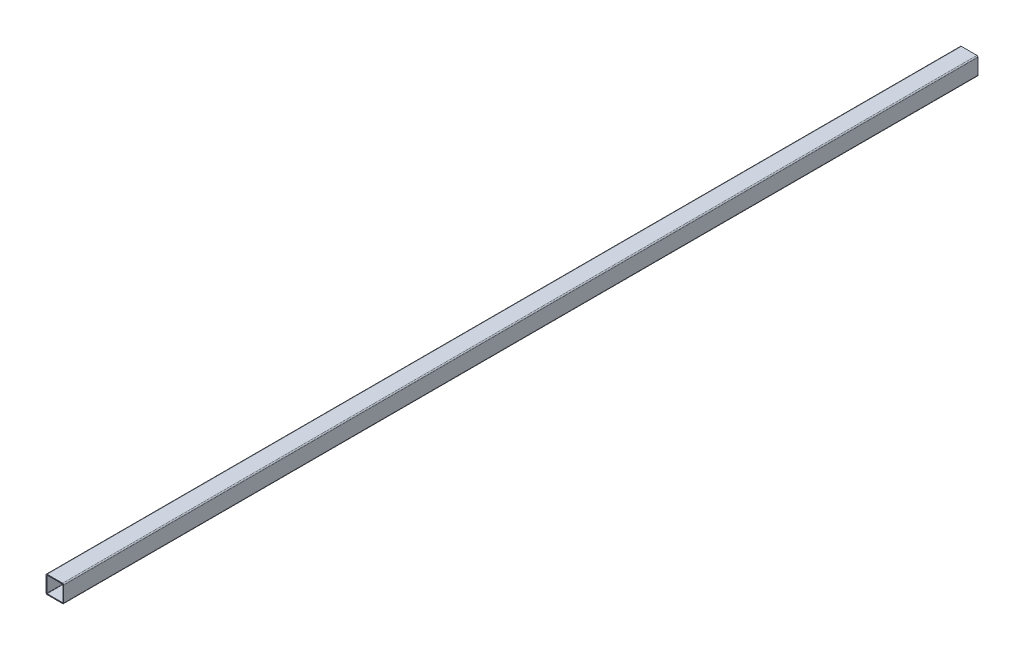
ISO-10303-21;
HEADER;
FILE_DESCRIPTION(('STEP AP214'),'2;1');
FILE_NAME('part.step','',(''),(''),'','','');
FILE_SCHEMA(('AUTOMOTIVE_DESIGN { 1 0 10303 214 1 1 1 1 }'));
ENDSEC;
DATA;
#1=APPLICATION_CONTEXT('core data for automotive mechanical design processes');
#2=APPLICATION_PROTOCOL_DEFINITION('international standard','automotive_design',2000,#1);
#3=PRODUCT_CONTEXT('',#1,'mechanical');
#4=PRODUCT('Part','Part','',(#3));
#5=PRODUCT_RELATED_PRODUCT_CATEGORY('part','',(#4));
#6=PRODUCT_DEFINITION_FORMATION('','',#4);
#7=PRODUCT_DEFINITION_CONTEXT('part definition',#1,'design');
#8=PRODUCT_DEFINITION('design','',#6,#7);
#9=PRODUCT_DEFINITION_SHAPE('','',#8);
#10=(LENGTH_UNIT() NAMED_UNIT(*) SI_UNIT(.MILLI.,.METRE.));
#11=(NAMED_UNIT(*) PLANE_ANGLE_UNIT() SI_UNIT($,.RADIAN.));
#12=(NAMED_UNIT(*) SI_UNIT($,.STERADIAN.) SOLID_ANGLE_UNIT());
#13=UNCERTAINTY_MEASURE_WITH_UNIT(LENGTH_MEASURE(1.E-05),#10,'distance_accuracy_value','');
#14=(GEOMETRIC_REPRESENTATION_CONTEXT(3) GLOBAL_UNCERTAINTY_ASSIGNED_CONTEXT((#13)) GLOBAL_UNIT_ASSIGNED_CONTEXT((#10,
#11,#12)) REPRESENTATION_CONTEXT('',''));
#15=CARTESIAN_POINT('',(0.,0.,0.));
#16=DIRECTION('',(0.,0.,1.));
#17=DIRECTION('',(1.,0.,0.));
#18=AXIS2_PLACEMENT_3D('',#15,#16,#17);
#19=CARTESIAN_POINT('',(14.,-14.,-825.));
#20=DIRECTION('',(0.,0.,1.));
#21=DIRECTION('',(1.,0.,0.));
#22=AXIS2_PLACEMENT_3D('',#19,#20,#21);
#23=CYLINDRICAL_SURFACE('',#22,2.);
#24=DIRECTION('',(0.,0.,1.));
#25=VECTOR('',#24,1.);
#26=CARTESIAN_POINT('',(16.,-14.,-825.));
#27=LINE('',#26,#25);
#28=CARTESIAN_POINT('',(16.,-14.,-825.));
#29=VERTEX_POINT('',#28);
#30=CARTESIAN_POINT('',(16.,-14.,825.));
#31=VERTEX_POINT('',#30);
#32=EDGE_CURVE('E42',#29,#31,#27,.T.);
#33=ORIENTED_EDGE('',*,*,#32,.T.);
#34=CARTESIAN_POINT('',(14.,-14.,825.));
#35=DIRECTION('',(0.,0.,1.));
#36=DIRECTION('',(1.,0.,0.));
#37=AXIS2_PLACEMENT_3D('',#34,#35,#36);
#38=CIRCLE('',#37,2.);
#39=CARTESIAN_POINT('',(14.,-16.,825.));
#40=VERTEX_POINT('',#39);
#41=EDGE_CURVE('E205',#40,#31,#38,.T.);
#42=ORIENTED_EDGE('',*,*,#41,.F.);
#43=DIRECTION('',(0.,0.,1.));
#44=VECTOR('',#43,1.);
#45=CARTESIAN_POINT('',(14.,-16.,-825.));
#46=LINE('',#45,#44);
#47=CARTESIAN_POINT('',(14.,-16.,-825.));
#48=VERTEX_POINT('',#47);
#49=EDGE_CURVE('E11',#48,#40,#46,.T.);
#50=ORIENTED_EDGE('',*,*,#49,.F.);
#51=CARTESIAN_POINT('',(14.,-14.,-825.));
#52=DIRECTION('',(0.,0.,1.));
#53=DIRECTION('',(1.,0.,0.));
#54=AXIS2_PLACEMENT_3D('',#51,#52,#53);
#55=CIRCLE('',#54,2.);
#56=EDGE_CURVE('E265',#48,#29,#55,.T.);
#57=ORIENTED_EDGE('',*,*,#56,.T.);
#58=EDGE_LOOP('',(#33,#42,#50,#57));
#59=FACE_BOUND('',#58,.T.);
#60=ADVANCED_FACE('F39',(#59),#23,.T.);
#61=CARTESIAN_POINT('',(-14.,-16.,-825.));
#62=DIRECTION('',(0.,-1.,0.));
#63=DIRECTION('',(0.,0.,-1.));
#64=AXIS2_PLACEMENT_3D('',#61,#62,#63);
#65=PLANE('',#64);
#66=ORIENTED_EDGE('',*,*,#49,.T.);
#67=DIRECTION('',(1.,0.,0.));
#68=VECTOR('',#67,1.);
#69=CARTESIAN_POINT('',(-14.,-16.,825.));
#70=LINE('',#69,#68);
#71=CARTESIAN_POINT('',(-14.,-16.,825.));
#72=VERTEX_POINT('',#71);
#73=EDGE_CURVE('E233',#72,#40,#70,.T.);
#74=ORIENTED_EDGE('',*,*,#73,.F.);
#75=DIRECTION('',(0.,0.,1.));
#76=VECTOR('',#75,1.);
#77=CARTESIAN_POINT('',(-14.,-16.,-825.));
#78=LINE('',#77,#76);
#79=CARTESIAN_POINT('',(-14.,-16.,-825.));
#80=VERTEX_POINT('',#79);
#81=EDGE_CURVE('E48',#80,#72,#78,.T.);
#82=ORIENTED_EDGE('',*,*,#81,.F.);
#83=DIRECTION('',(1.,0.,0.));
#84=VECTOR('',#83,1.);
#85=CARTESIAN_POINT('',(-14.,-16.,-825.));
#86=LINE('',#85,#84);
#87=EDGE_CURVE('E309',#80,#48,#86,.T.);
#88=ORIENTED_EDGE('',*,*,#87,.T.);
#89=EDGE_LOOP('',(#66,#74,#82,#88));
#90=FACE_BOUND('',#89,.T.);
#91=ADVANCED_FACE('F338',(#90),#65,.T.);
#92=CARTESIAN_POINT('',(-14.,-14.,-825.));
#93=DIRECTION('',(0.,0.,1.));
#94=DIRECTION('',(1.,0.,0.));
#95=AXIS2_PLACEMENT_3D('',#92,#93,#94);
#96=CYLINDRICAL_SURFACE('',#95,2.);
#97=ORIENTED_EDGE('',*,*,#81,.T.);
#98=CARTESIAN_POINT('',(-14.,-14.,825.));
#99=DIRECTION('',(0.,0.,1.));
#100=DIRECTION('',(1.,0.,0.));
#101=AXIS2_PLACEMENT_3D('',#98,#99,#100);
#102=CIRCLE('',#101,2.);
#103=CARTESIAN_POINT('',(-16.,-14.,825.));
#104=VERTEX_POINT('',#103);
#105=EDGE_CURVE('E229',#104,#72,#102,.T.);
#106=ORIENTED_EDGE('',*,*,#105,.F.);
#107=DIRECTION('',(0.,0.,1.));
#108=VECTOR('',#107,1.);
#109=CARTESIAN_POINT('',(-16.,-14.,-825.));
#110=LINE('',#109,#108);
#111=CARTESIAN_POINT('',(-16.,-14.,-825.));
#112=VERTEX_POINT('',#111);
#113=EDGE_CURVE('E315',#112,#104,#110,.T.);
#114=ORIENTED_EDGE('',*,*,#113,.F.);
#115=CARTESIAN_POINT('',(-14.,-14.,-825.));
#116=DIRECTION('',(0.,0.,1.));
#117=DIRECTION('',(1.,0.,0.));
#118=AXIS2_PLACEMENT_3D('',#115,#116,#117);
#119=CIRCLE('',#118,2.);
#120=EDGE_CURVE('E305',#112,#80,#119,.T.);
#121=ORIENTED_EDGE('',*,*,#120,.T.);
#122=EDGE_LOOP('',(#97,#106,#114,#121));
#123=FACE_BOUND('',#122,.T.);
#124=ADVANCED_FACE('F359',(#123),#96,.T.);
#125=CARTESIAN_POINT('',(-16.,-14.,-825.));
#126=DIRECTION('',(-1.,0.,0.));
#127=DIRECTION('',(0.,0.,1.));
#128=AXIS2_PLACEMENT_3D('',#125,#126,#127);
#129=PLANE('',#128);
#130=ORIENTED_EDGE('',*,*,#113,.T.);
#131=DIRECTION('',(0.,-1.,0.));
#132=VECTOR('',#131,1.);
#133=CARTESIAN_POINT('',(-16.,-14.,825.));
#134=LINE('',#133,#132);
#135=CARTESIAN_POINT('',(-16.,14.,825.));
#136=VERTEX_POINT('',#135);
#137=EDGE_CURVE('E225',#136,#104,#134,.T.);
#138=ORIENTED_EDGE('',*,*,#137,.F.);
#139=DIRECTION('',(0.,0.,1.));
#140=VECTOR('',#139,1.);
#141=CARTESIAN_POINT('',(-16.,14.,-825.));
#142=LINE('',#141,#140);
#143=CARTESIAN_POINT('',(-16.,14.,-825.));
#144=VERTEX_POINT('',#143);
#145=EDGE_CURVE('E318',#144,#136,#142,.T.);
#146=ORIENTED_EDGE('',*,*,#145,.F.);
#147=DIRECTION('',(0.,-1.,0.));
#148=VECTOR('',#147,1.);
#149=CARTESIAN_POINT('',(-16.,-14.,-825.));
#150=LINE('',#149,#148);
#151=EDGE_CURVE('E301',#144,#112,#150,.T.);
#152=ORIENTED_EDGE('',*,*,#151,.T.);
#153=EDGE_LOOP('',(#130,#138,#146,#152));
#154=FACE_BOUND('',#153,.T.);
#155=ADVANCED_FACE('F356',(#154),#129,.T.);
#156=CARTESIAN_POINT('',(-14.,14.,-825.));
#157=DIRECTION('',(0.,0.,1.));
#158=DIRECTION('',(1.,0.,0.));
#159=AXIS2_PLACEMENT_3D('',#156,#157,#158);
#160=CYLINDRICAL_SURFACE('',#159,2.);
#161=ORIENTED_EDGE('',*,*,#145,.T.);
#162=CARTESIAN_POINT('',(-14.,14.,825.));
#163=DIRECTION('',(0.,0.,1.));
#164=DIRECTION('',(-1.,0.,0.));
#165=AXIS2_PLACEMENT_3D('',#162,#163,#164);
#166=CIRCLE('',#165,2.);
#167=CARTESIAN_POINT('',(-14.,16.,825.));
#168=VERTEX_POINT('',#167);
#169=EDGE_CURVE('E221',#168,#136,#166,.T.);
#170=ORIENTED_EDGE('',*,*,#169,.F.);
#171=DIRECTION('',(0.,0.,1.));
#172=VECTOR('',#171,1.);
#173=CARTESIAN_POINT('',(-14.,16.,-825.));
#174=LINE('',#173,#172);
#175=CARTESIAN_POINT('',(-14.,16.,-825.));
#176=VERTEX_POINT('',#175);
#177=EDGE_CURVE('E321',#176,#168,#174,.T.);
#178=ORIENTED_EDGE('',*,*,#177,.F.);
#179=CARTESIAN_POINT('',(-14.,14.,-825.));
#180=DIRECTION('',(0.,0.,1.));
#181=DIRECTION('',(-1.,0.,0.));
#182=AXIS2_PLACEMENT_3D('',#179,#180,#181);
#183=CIRCLE('',#182,2.);
#184=EDGE_CURVE('E297',#176,#144,#183,.T.);
#185=ORIENTED_EDGE('',*,*,#184,.T.);
#186=EDGE_LOOP('',(#161,#170,#178,#185));
#187=FACE_BOUND('',#186,.T.);
#188=ADVANCED_FACE('F354',(#187),#160,.T.);
#189=CARTESIAN_POINT('',(-14.,16.,-825.));
#190=DIRECTION('',(0.,1.,0.));
#191=DIRECTION('',(0.,0.,1.));
#192=AXIS2_PLACEMENT_3D('',#189,#190,#191);
#193=PLANE('',#192);
#194=ORIENTED_EDGE('',*,*,#177,.T.);
#195=DIRECTION('',(-1.,0.,0.));
#196=VECTOR('',#195,1.);
#197=CARTESIAN_POINT('',(-14.,16.,825.));
#198=LINE('',#197,#196);
#199=CARTESIAN_POINT('',(14.,16.,825.));
#200=VERTEX_POINT('',#199);
#201=EDGE_CURVE('E217',#200,#168,#198,.T.);
#202=ORIENTED_EDGE('',*,*,#201,.F.);
#203=DIRECTION('',(0.,0.,1.));
#204=VECTOR('',#203,1.);
#205=CARTESIAN_POINT('',(14.,16.,-825.));
#206=LINE('',#205,#204);
#207=CARTESIAN_POINT('',(14.,16.,-825.));
#208=VERTEX_POINT('',#207);
#209=EDGE_CURVE('E324',#208,#200,#206,.T.);
#210=ORIENTED_EDGE('',*,*,#209,.F.);
#211=DIRECTION('',(-1.,0.,0.));
#212=VECTOR('',#211,1.);
#213=CARTESIAN_POINT('',(-14.,16.,-825.));
#214=LINE('',#213,#212);
#215=EDGE_CURVE('E293',#208,#176,#214,.T.);
#216=ORIENTED_EDGE('',*,*,#215,.T.);
#217=EDGE_LOOP('',(#194,#202,#210,#216));
#218=FACE_BOUND('',#217,.T.);
#219=ADVANCED_FACE('F352',(#218),#193,.T.);
#220=CARTESIAN_POINT('',(14.,14.,-825.));
#221=DIRECTION('',(0.,0.,1.));
#222=DIRECTION('',(1.,0.,0.));
#223=AXIS2_PLACEMENT_3D('',#220,#221,#222);
#224=CYLINDRICAL_SURFACE('',#223,2.);
#225=ORIENTED_EDGE('',*,*,#209,.T.);
#226=CARTESIAN_POINT('',(14.,14.,825.));
#227=DIRECTION('',(0.,0.,1.));
#228=DIRECTION('',(1.,0.,0.));
#229=AXIS2_PLACEMENT_3D('',#226,#227,#228);
#230=CIRCLE('',#229,2.);
#231=CARTESIAN_POINT('',(16.,14.,825.));
#232=VERTEX_POINT('',#231);
#233=EDGE_CURVE('E213',#232,#200,#230,.T.);
#234=ORIENTED_EDGE('',*,*,#233,.F.);
#235=DIRECTION('',(0.,0.,1.));
#236=VECTOR('',#235,1.);
#237=CARTESIAN_POINT('',(16.,14.,-825.));
#238=LINE('',#237,#236);
#239=CARTESIAN_POINT('',(16.,14.,-825.));
#240=VERTEX_POINT('',#239);
#241=EDGE_CURVE('E326',#240,#232,#238,.T.);
#242=ORIENTED_EDGE('',*,*,#241,.F.);
#243=CARTESIAN_POINT('',(14.,14.,-825.));
#244=DIRECTION('',(0.,0.,1.));
#245=DIRECTION('',(1.,0.,0.));
#246=AXIS2_PLACEMENT_3D('',#243,#244,#245);
#247=CIRCLE('',#246,2.);
#248=EDGE_CURVE('E289',#240,#208,#247,.T.);
#249=ORIENTED_EDGE('',*,*,#248,.T.);
#250=EDGE_LOOP('',(#225,#234,#242,#249));
#251=FACE_BOUND('',#250,.T.);
#252=ADVANCED_FACE('F348',(#251),#224,.T.);
#253=CARTESIAN_POINT('',(16.,-14.,-825.));
#254=DIRECTION('',(1.,0.,0.));
#255=DIRECTION('',(0.,0.,-1.));
#256=AXIS2_PLACEMENT_3D('',#253,#254,#255);
#257=PLANE('',#256);
#258=ORIENTED_EDGE('',*,*,#241,.T.);
#259=DIRECTION('',(0.,1.,0.));
#260=VECTOR('',#259,1.);
#261=CARTESIAN_POINT('',(16.,-14.,825.));
#262=LINE('',#261,#260);
#263=EDGE_CURVE('E209',#31,#232,#262,.T.);
#264=ORIENTED_EDGE('',*,*,#263,.F.);
#265=ORIENTED_EDGE('',*,*,#32,.F.);
#266=DIRECTION('',(0.,1.,0.));
#267=VECTOR('',#266,1.);
#268=CARTESIAN_POINT('',(16.,-14.,-825.));
#269=LINE('',#268,#267);
#270=EDGE_CURVE('E285',#29,#240,#269,.T.);
#271=ORIENTED_EDGE('',*,*,#270,.T.);
#272=EDGE_LOOP('',(#258,#264,#265,#271));
#273=FACE_BOUND('',#272,.T.);
#274=ADVANCED_FACE('F332',(#273),#257,.T.);
#275=CARTESIAN_POINT('',(14.,-14.,-825.));
#276=DIRECTION('',(0.,0.,1.));
#277=DIRECTION('',(1.,0.,0.));
#278=AXIS2_PLACEMENT_3D('',#275,#276,#277);
#279=PLANE('',#278);
#280=DIRECTION('',(-1.,0.,0.));
#281=VECTOR('',#280,1.);
#282=CARTESIAN_POINT('',(-14.,14.48,-825.));
#283=LINE('',#282,#281);
#284=CARTESIAN_POINT('',(14.,14.48,-825.));
#285=VERTEX_POINT('',#284);
#286=CARTESIAN_POINT('',(-14.,14.48,-825.));
#287=VERTEX_POINT('',#286);
#288=EDGE_CURVE('E166',#285,#287,#283,.T.);
#289=ORIENTED_EDGE('',*,*,#288,.T.);
#290=CARTESIAN_POINT('',(-14.,14.,-825.));
#291=DIRECTION('',(0.,0.,1.));
#292=DIRECTION('',(-1.,0.,0.));
#293=AXIS2_PLACEMENT_3D('',#290,#291,#292);
#294=CIRCLE('',#293,0.48);
#295=CARTESIAN_POINT('',(-14.48,14.,-825.));
#296=VERTEX_POINT('',#295);
#297=EDGE_CURVE('E237',#287,#296,#294,.T.);
#298=ORIENTED_EDGE('',*,*,#297,.T.);
#299=DIRECTION('',(0.,-1.,0.));
#300=VECTOR('',#299,1.);
#301=CARTESIAN_POINT('',(-14.48,-14.,-825.));
#302=LINE('',#301,#300);
#303=CARTESIAN_POINT('',(-14.48,-14.,-825.));
#304=VERTEX_POINT('',#303);
#305=EDGE_CURVE('E160',#296,#304,#302,.T.);
#306=ORIENTED_EDGE('',*,*,#305,.T.);
#307=CARTESIAN_POINT('',(-14.,-14.,-825.));
#308=DIRECTION('',(0.,0.,1.));
#309=DIRECTION('',(1.,0.,0.));
#310=AXIS2_PLACEMENT_3D('',#307,#308,#309);
#311=CIRCLE('',#310,0.48);
#312=CARTESIAN_POINT('',(-14.,-14.48,-825.));
#313=VERTEX_POINT('',#312);
#314=EDGE_CURVE('E56',#304,#313,#311,.T.);
#315=ORIENTED_EDGE('',*,*,#314,.T.);
#316=DIRECTION('',(1.,0.,0.));
#317=VECTOR('',#316,1.);
#318=CARTESIAN_POINT('',(-14.,-14.48,-825.));
#319=LINE('',#318,#317);
#320=CARTESIAN_POINT('',(14.,-14.48,-825.));
#321=VERTEX_POINT('',#320);
#322=EDGE_CURVE('E244',#313,#321,#319,.T.);
#323=ORIENTED_EDGE('',*,*,#322,.T.);
#324=CARTESIAN_POINT('',(14.,-14.,-825.));
#325=DIRECTION('',(0.,0.,1.));
#326=DIRECTION('',(1.,0.,0.));
#327=AXIS2_PLACEMENT_3D('',#324,#325,#326);
#328=CIRCLE('',#327,0.48);
#329=CARTESIAN_POINT('',(14.48,-14.,-825.));
#330=VERTEX_POINT('',#329);
#331=EDGE_CURVE('E248',#321,#330,#328,.T.);
#332=ORIENTED_EDGE('',*,*,#331,.T.);
#333=DIRECTION('',(0.,1.,0.));
#334=VECTOR('',#333,1.);
#335=CARTESIAN_POINT('',(14.48,-14.,-825.));
#336=LINE('',#335,#334);
#337=CARTESIAN_POINT('',(14.48,14.,-825.));
#338=VERTEX_POINT('',#337);
#339=EDGE_CURVE('E252',#330,#338,#336,.T.);
#340=ORIENTED_EDGE('',*,*,#339,.T.);
#341=CARTESIAN_POINT('',(14.,14.,-825.));
#342=DIRECTION('',(0.,0.,1.));
#343=DIRECTION('',(1.,0.,0.));
#344=AXIS2_PLACEMENT_3D('',#341,#342,#343);
#345=CIRCLE('',#344,0.48);
#346=EDGE_CURVE('E256',#338,#285,#345,.T.);
#347=ORIENTED_EDGE('',*,*,#346,.T.);
#348=EDGE_LOOP('',(#289,#298,#306,#315,#323,#332,#340,#347));
#349=FACE_BOUND('',#348,.T.);
#350=ORIENTED_EDGE('',*,*,#56,.F.);
#351=ORIENTED_EDGE('',*,*,#87,.F.);
#352=ORIENTED_EDGE('',*,*,#120,.F.);
#353=ORIENTED_EDGE('',*,*,#151,.F.);
#354=ORIENTED_EDGE('',*,*,#184,.F.);
#355=ORIENTED_EDGE('',*,*,#215,.F.);
#356=ORIENTED_EDGE('',*,*,#248,.F.);
#357=ORIENTED_EDGE('',*,*,#270,.F.);
#358=EDGE_LOOP('',(#350,#351,#352,#353,#354,#355,#356,#357));
#359=FACE_BOUND('',#358,.T.);
#360=ADVANCED_FACE('F342',(#349,#359),#279,.F.);
#361=CARTESIAN_POINT('',(-14.,14.,-825.));
#362=DIRECTION('',(0.,0.,1.));
#363=DIRECTION('',(1.,0.,0.));
#364=AXIS2_PLACEMENT_3D('',#361,#362,#363);
#365=CYLINDRICAL_SURFACE('',#364,0.48);
#366=DIRECTION('',(0.,0.,1.));
#367=VECTOR('',#366,1.);
#368=CARTESIAN_POINT('',(-14.,14.48,-825.));
#369=LINE('',#368,#367);
#370=CARTESIAN_POINT('',(-14.,14.48,825.));
#371=VERTEX_POINT('',#370);
#372=EDGE_CURVE('E171',#287,#371,#369,.T.);
#373=ORIENTED_EDGE('',*,*,#372,.T.);
#374=CARTESIAN_POINT('',(-14.,14.,825.));
#375=DIRECTION('',(0.,0.,1.));
#376=DIRECTION('',(-1.,0.,0.));
#377=AXIS2_PLACEMENT_3D('',#374,#375,#376);
#378=CIRCLE('',#377,0.48);
#379=CARTESIAN_POINT('',(-14.48,14.,825.));
#380=VERTEX_POINT('',#379);
#381=EDGE_CURVE('E169',#371,#380,#378,.T.);
#382=ORIENTED_EDGE('',*,*,#381,.T.);
#383=DIRECTION('',(0.,0.,1.));
#384=VECTOR('',#383,1.);
#385=CARTESIAN_POINT('',(-14.48,14.,-825.));
#386=LINE('',#385,#384);
#387=EDGE_CURVE('E153',#296,#380,#386,.T.);
#388=ORIENTED_EDGE('',*,*,#387,.F.);
#389=ORIENTED_EDGE('',*,*,#297,.F.);
#390=EDGE_LOOP('',(#373,#382,#388,#389));
#391=FACE_BOUND('',#390,.T.);
#392=ADVANCED_FACE('F170',(#391),#365,.F.);
#393=CARTESIAN_POINT('',(-14.,14.48,-825.));
#394=DIRECTION('',(0.,1.,0.));
#395=DIRECTION('',(0.,0.,1.));
#396=AXIS2_PLACEMENT_3D('',#393,#394,#395);
#397=PLANE('',#396);
#398=DIRECTION('',(0.,0.,1.));
#399=VECTOR('',#398,1.);
#400=CARTESIAN_POINT('',(14.,14.48,-825.));
#401=LINE('',#400,#399);
#402=CARTESIAN_POINT('',(14.,14.48,825.));
#403=VERTEX_POINT('',#402);
#404=EDGE_CURVE('E266',#285,#403,#401,.T.);
#405=ORIENTED_EDGE('',*,*,#404,.T.);
#406=DIRECTION('',(-1.,0.,0.));
#407=VECTOR('',#406,1.);
#408=CARTESIAN_POINT('',(-14.,14.48,825.));
#409=LINE('',#408,#407);
#410=EDGE_CURVE('E202',#403,#371,#409,.T.);
#411=ORIENTED_EDGE('',*,*,#410,.T.);
#412=ORIENTED_EDGE('',*,*,#372,.F.);
#413=ORIENTED_EDGE('',*,*,#288,.F.);
#414=EDGE_LOOP('',(#405,#411,#412,#413));
#415=FACE_BOUND('',#414,.T.);
#416=ADVANCED_FACE('F434',(#415),#397,.F.);
#417=CARTESIAN_POINT('',(14.,14.,-825.));
#418=DIRECTION('',(0.,0.,1.));
#419=DIRECTION('',(1.,0.,0.));
#420=AXIS2_PLACEMENT_3D('',#417,#418,#419);
#421=CYLINDRICAL_SURFACE('',#420,0.48);
#422=DIRECTION('',(0.,0.,1.));
#423=VECTOR('',#422,1.);
#424=CARTESIAN_POINT('',(14.48,14.,-825.));
#425=LINE('',#424,#423);
#426=CARTESIAN_POINT('',(14.48,14.,825.));
#427=VERTEX_POINT('',#426);
#428=EDGE_CURVE('E269',#338,#427,#425,.T.);
#429=ORIENTED_EDGE('',*,*,#428,.T.);
#430=CARTESIAN_POINT('',(14.,14.,825.));
#431=DIRECTION('',(0.,0.,1.));
#432=DIRECTION('',(1.,0.,0.));
#433=AXIS2_PLACEMENT_3D('',#430,#431,#432);
#434=CIRCLE('',#433,0.48);
#435=EDGE_CURVE('E198',#427,#403,#434,.T.);
#436=ORIENTED_EDGE('',*,*,#435,.T.);
#437=ORIENTED_EDGE('',*,*,#404,.F.);
#438=ORIENTED_EDGE('',*,*,#346,.F.);
#439=EDGE_LOOP('',(#429,#436,#437,#438));
#440=FACE_BOUND('',#439,.T.);
#441=ADVANCED_FACE('F443',(#440),#421,.F.);
#442=CARTESIAN_POINT('',(14.48,-14.,-825.));
#443=DIRECTION('',(1.,0.,0.));
#444=DIRECTION('',(0.,0.,-1.));
#445=AXIS2_PLACEMENT_3D('',#442,#443,#444);
#446=PLANE('',#445);
#447=DIRECTION('',(0.,0.,1.));
#448=VECTOR('',#447,1.);
#449=CARTESIAN_POINT('',(14.48,-14.,-825.));
#450=LINE('',#449,#448);
#451=CARTESIAN_POINT('',(14.48,-14.,825.));
#452=VERTEX_POINT('',#451);
#453=EDGE_CURVE('E272',#330,#452,#450,.T.);
#454=ORIENTED_EDGE('',*,*,#453,.T.);
#455=DIRECTION('',(0.,1.,0.));
#456=VECTOR('',#455,1.);
#457=CARTESIAN_POINT('',(14.48,-14.,825.));
#458=LINE('',#457,#456);
#459=EDGE_CURVE('E194',#452,#427,#458,.T.);
#460=ORIENTED_EDGE('',*,*,#459,.T.);
#461=ORIENTED_EDGE('',*,*,#428,.F.);
#462=ORIENTED_EDGE('',*,*,#339,.F.);
#463=EDGE_LOOP('',(#454,#460,#461,#462));
#464=FACE_BOUND('',#463,.T.);
#465=ADVANCED_FACE('F453',(#464),#446,.F.);
#466=CARTESIAN_POINT('',(14.,-14.,-825.));
#467=DIRECTION('',(0.,0.,1.));
#468=DIRECTION('',(1.,0.,0.));
#469=AXIS2_PLACEMENT_3D('',#466,#467,#468);
#470=CYLINDRICAL_SURFACE('',#469,0.48);
#471=DIRECTION('',(0.,0.,1.));
#472=VECTOR('',#471,1.);
#473=CARTESIAN_POINT('',(14.,-14.48,-825.));
#474=LINE('',#473,#472);
#475=CARTESIAN_POINT('',(14.,-14.48,825.));
#476=VERTEX_POINT('',#475);
#477=EDGE_CURVE('E275',#321,#476,#474,.T.);
#478=ORIENTED_EDGE('',*,*,#477,.T.);
#479=CARTESIAN_POINT('',(14.,-14.,825.));
#480=DIRECTION('',(0.,0.,1.));
#481=DIRECTION('',(1.,0.,0.));
#482=AXIS2_PLACEMENT_3D('',#479,#480,#481);
#483=CIRCLE('',#482,0.48);
#484=EDGE_CURVE('E190',#476,#452,#483,.T.);
#485=ORIENTED_EDGE('',*,*,#484,.T.);
#486=ORIENTED_EDGE('',*,*,#453,.F.);
#487=ORIENTED_EDGE('',*,*,#331,.F.);
#488=EDGE_LOOP('',(#478,#485,#486,#487));
#489=FACE_BOUND('',#488,.T.);
#490=ADVANCED_FACE('F463',(#489),#470,.F.);
#491=CARTESIAN_POINT('',(-14.,-14.48,-825.));
#492=DIRECTION('',(0.,-1.,0.));
#493=DIRECTION('',(0.,0.,-1.));
#494=AXIS2_PLACEMENT_3D('',#491,#492,#493);
#495=PLANE('',#494);
#496=DIRECTION('',(0.,0.,1.));
#497=VECTOR('',#496,1.);
#498=CARTESIAN_POINT('',(-14.,-14.48,-825.));
#499=LINE('',#498,#497);
#500=CARTESIAN_POINT('',(-14.,-14.48,825.));
#501=VERTEX_POINT('',#500);
#502=EDGE_CURVE('E278',#313,#501,#499,.T.);
#503=ORIENTED_EDGE('',*,*,#502,.T.);
#504=DIRECTION('',(1.,0.,0.));
#505=VECTOR('',#504,1.);
#506=CARTESIAN_POINT('',(-14.,-14.48,825.));
#507=LINE('',#506,#505);
#508=EDGE_CURVE('E184',#501,#476,#507,.T.);
#509=ORIENTED_EDGE('',*,*,#508,.T.);
#510=ORIENTED_EDGE('',*,*,#477,.F.);
#511=ORIENTED_EDGE('',*,*,#322,.F.);
#512=EDGE_LOOP('',(#503,#509,#510,#511));
#513=FACE_BOUND('',#512,.T.);
#514=ADVANCED_FACE('F473',(#513),#495,.F.);
#515=CARTESIAN_POINT('',(-14.,-14.,-825.));
#516=DIRECTION('',(0.,0.,1.));
#517=DIRECTION('',(1.,0.,0.));
#518=AXIS2_PLACEMENT_3D('',#515,#516,#517);
#519=CYLINDRICAL_SURFACE('',#518,0.48);
#520=DIRECTION('',(0.,0.,1.));
#521=VECTOR('',#520,1.);
#522=CARTESIAN_POINT('',(-14.48,-14.,-825.));
#523=LINE('',#522,#521);
#524=CARTESIAN_POINT('',(-14.48,-14.,825.));
#525=VERTEX_POINT('',#524);
#526=EDGE_CURVE('E165',#304,#525,#523,.T.);
#527=ORIENTED_EDGE('',*,*,#526,.T.);
#528=CARTESIAN_POINT('',(-14.,-14.,825.));
#529=DIRECTION('',(0.,0.,1.));
#530=DIRECTION('',(1.,0.,0.));
#531=AXIS2_PLACEMENT_3D('',#528,#529,#530);
#532=CIRCLE('',#531,0.48);
#533=EDGE_CURVE('E180',#525,#501,#532,.T.);
#534=ORIENTED_EDGE('',*,*,#533,.T.);
#535=ORIENTED_EDGE('',*,*,#502,.F.);
#536=ORIENTED_EDGE('',*,*,#314,.F.);
#537=EDGE_LOOP('',(#527,#534,#535,#536));
#538=FACE_BOUND('',#537,.T.);
#539=ADVANCED_FACE('F483',(#538),#519,.F.);
#540=CARTESIAN_POINT('',(-14.48,-14.,-825.));
#541=DIRECTION('',(-1.,0.,0.));
#542=DIRECTION('',(0.,0.,1.));
#543=AXIS2_PLACEMENT_3D('',#540,#541,#542);
#544=PLANE('',#543);
#545=ORIENTED_EDGE('',*,*,#387,.T.);
#546=DIRECTION('',(0.,-1.,0.));
#547=VECTOR('',#546,1.);
#548=CARTESIAN_POINT('',(-14.48,-14.,825.));
#549=LINE('',#548,#547);
#550=EDGE_CURVE('E157',#380,#525,#549,.T.);
#551=ORIENTED_EDGE('',*,*,#550,.T.);
#552=ORIENTED_EDGE('',*,*,#526,.F.);
#553=ORIENTED_EDGE('',*,*,#305,.F.);
#554=EDGE_LOOP('',(#545,#551,#552,#553));
#555=FACE_BOUND('',#554,.T.);
#556=ADVANCED_FACE('F155',(#555),#544,.F.);
#557=CARTESIAN_POINT('',(14.,-14.,825.));
#558=DIRECTION('',(0.,0.,1.));
#559=DIRECTION('',(1.,0.,0.));
#560=AXIS2_PLACEMENT_3D('',#557,#558,#559);
#561=PLANE('',#560);
#562=ORIENTED_EDGE('',*,*,#41,.T.);
#563=ORIENTED_EDGE('',*,*,#263,.T.);
#564=ORIENTED_EDGE('',*,*,#233,.T.);
#565=ORIENTED_EDGE('',*,*,#201,.T.);
#566=ORIENTED_EDGE('',*,*,#169,.T.);
#567=ORIENTED_EDGE('',*,*,#137,.T.);
#568=ORIENTED_EDGE('',*,*,#105,.T.);
#569=ORIENTED_EDGE('',*,*,#73,.T.);
#570=EDGE_LOOP('',(#562,#563,#564,#565,#566,#567,#568,#569));
#571=FACE_BOUND('',#570,.T.);
#572=ORIENTED_EDGE('',*,*,#550,.F.);
#573=ORIENTED_EDGE('',*,*,#381,.F.);
#574=ORIENTED_EDGE('',*,*,#410,.F.);
#575=ORIENTED_EDGE('',*,*,#435,.F.);
#576=ORIENTED_EDGE('',*,*,#459,.F.);
#577=ORIENTED_EDGE('',*,*,#484,.F.);
#578=ORIENTED_EDGE('',*,*,#508,.F.);
#579=ORIENTED_EDGE('',*,*,#533,.F.);
#580=EDGE_LOOP('',(#572,#573,#574,#575,#576,#577,#578,#579));
#581=FACE_BOUND('',#580,.T.);
#582=ADVANCED_FACE('F177',(#571,#581),#561,.T.);
#583=CLOSED_SHELL('',(#60,#91,#124,#155,#188,#219,#252,#274,#360,#392,#416,#441,#465,#490,#514,
#539,#556,#582));
#584=MANIFOLD_SOLID_BREP('B2',#583);
#585=ADVANCED_BREP_SHAPE_REPRESENTATION('',(#18,#584),#14);
#586=SHAPE_DEFINITION_REPRESENTATION(#9,#585);
ENDSEC;
END-ISO-10303-21;
